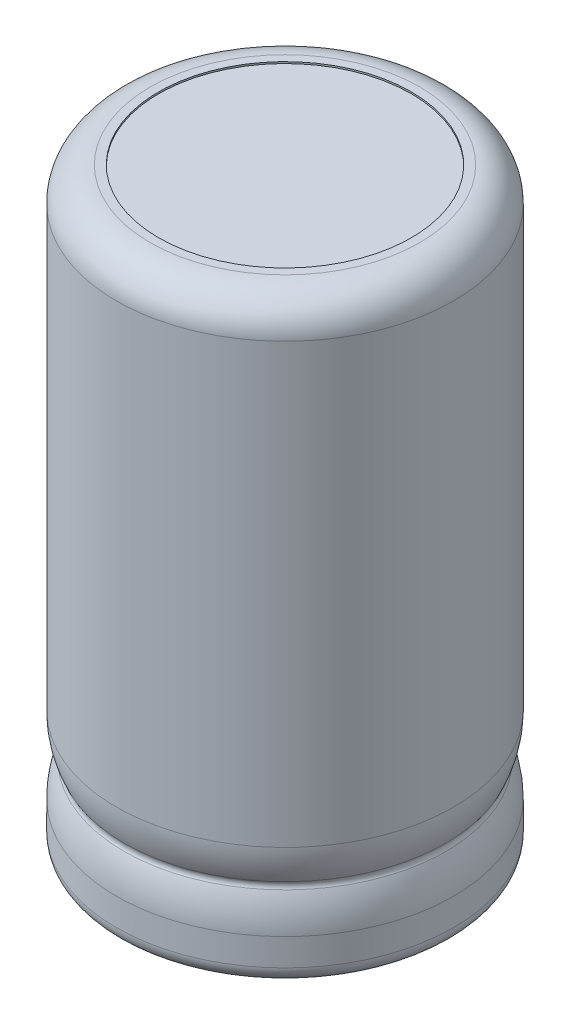
ISO-10303-21;
HEADER;
FILE_DESCRIPTION(('STEP AP214'),'2;1');
FILE_NAME('part.step','',(''),(''),'','','');
FILE_SCHEMA(('AUTOMOTIVE_DESIGN { 1 0 10303 214 1 1 1 1 }'));
ENDSEC;
DATA;
#1=APPLICATION_CONTEXT('core data for automotive mechanical design processes');
#2=APPLICATION_PROTOCOL_DEFINITION('international standard','automotive_design',2000,#1);
#3=PRODUCT_CONTEXT('',#1,'mechanical');
#4=PRODUCT('Part','Part','',(#3));
#5=PRODUCT_RELATED_PRODUCT_CATEGORY('part','',(#4));
#6=PRODUCT_DEFINITION_FORMATION('','',#4);
#7=PRODUCT_DEFINITION_CONTEXT('part definition',#1,'design');
#8=PRODUCT_DEFINITION('design','',#6,#7);
#9=PRODUCT_DEFINITION_SHAPE('','',#8);
#10=(LENGTH_UNIT() NAMED_UNIT(*) SI_UNIT(.MILLI.,.METRE.));
#11=(NAMED_UNIT(*) PLANE_ANGLE_UNIT() SI_UNIT($,.RADIAN.));
#12=(NAMED_UNIT(*) SI_UNIT($,.STERADIAN.) SOLID_ANGLE_UNIT());
#13=UNCERTAINTY_MEASURE_WITH_UNIT(LENGTH_MEASURE(1.E-05),#10,'distance_accuracy_value','');
#14=(GEOMETRIC_REPRESENTATION_CONTEXT(3) GLOBAL_UNCERTAINTY_ASSIGNED_CONTEXT((#13)) GLOBAL_UNIT_ASSIGNED_CONTEXT((#10,
#11,#12)) REPRESENTATION_CONTEXT('',''));
#15=CARTESIAN_POINT('',(0.,0.,0.));
#16=DIRECTION('',(0.,0.,1.));
#17=DIRECTION('',(1.,0.,0.));
#18=AXIS2_PLACEMENT_3D('',#15,#16,#17);
#19=CARTESIAN_POINT('',(-5.08,0.,0.));
#20=DIRECTION('',(0.,1.,0.));
#21=DIRECTION('',(0.,0.,1.));
#22=AXIS2_PLACEMENT_3D('',#19,#20,#21);
#23=PLANE('',#22);
#24=CARTESIAN_POINT('',(-5.08,0.,0.));
#25=DIRECTION('',(0.,1.,0.));
#26=DIRECTION('',(0.,0.,1.));
#27=AXIS2_PLACEMENT_3D('',#24,#25,#26);
#28=CIRCLE('',#27,9.);
#29=CARTESIAN_POINT('',(-5.08,0.,9.));
#30=VERTEX_POINT('',#29);
#31=EDGE_CURVE('E38',#30,#30,#28,.F.);
#32=ORIENTED_EDGE('',*,*,#31,.T.);
#33=EDGE_LOOP('',(#32));
#34=FACE_BOUND('',#33,.T.);
#35=CARTESIAN_POINT('',(-5.08,0.,0.));
#36=DIRECTION('',(0.,-1.,0.));
#37=DIRECTION('',(0.,0.,-1.));
#38=AXIS2_PLACEMENT_3D('',#35,#36,#37);
#39=CIRCLE('',#38,7.5);
#40=CARTESIAN_POINT('',(-5.08,0.,-7.5));
#41=VERTEX_POINT('',#40);
#42=EDGE_CURVE('E58',#41,#41,#39,.T.);
#43=ORIENTED_EDGE('',*,*,#42,.F.);
#44=EDGE_LOOP('',(#43));
#45=FACE_BOUND('',#44,.T.);
#46=ADVANCED_FACE('F31',(#34,#45),#23,.F.);
#47=CARTESIAN_POINT('',(-5.08,35.2,0.));
#48=DIRECTION('',(0.,-1.,0.));
#49=DIRECTION('',(0.,0.,-1.));
#50=AXIS2_PLACEMENT_3D('',#47,#48,#49);
#51=CYLINDRICAL_SURFACE('',#50,10.);
#52=CARTESIAN_POINT('',(-5.08,2.61,0.));
#53=DIRECTION('',(0.,-1.,0.));
#54=DIRECTION('',(0.,0.,-1.));
#55=AXIS2_PLACEMENT_3D('',#52,#53,#54);
#56=CIRCLE('',#55,10.);
#57=CARTESIAN_POINT('',(-5.08,2.61,-10.));
#58=VERTEX_POINT('',#57);
#59=EDGE_CURVE('E72',#58,#58,#56,.T.);
#60=ORIENTED_EDGE('',*,*,#59,.T.);
#61=EDGE_LOOP('',(#60));
#62=FACE_BOUND('',#61,.T.);
#63=CARTESIAN_POINT('',(-5.08,1.,0.));
#64=DIRECTION('',(0.,1.,0.));
#65=DIRECTION('',(0.,0.,1.));
#66=AXIS2_PLACEMENT_3D('',#63,#64,#65);
#67=CIRCLE('',#66,10.);
#68=CARTESIAN_POINT('',(-5.08,1.,10.));
#69=VERTEX_POINT('',#68);
#70=EDGE_CURVE('E10',#69,#69,#67,.T.);
#71=ORIENTED_EDGE('',*,*,#70,.T.);
#72=EDGE_LOOP('',(#71));
#73=FACE_BOUND('',#72,.T.);
#74=ADVANCED_FACE('F112',(#62,#73),#51,.T.);
#75=CARTESIAN_POINT('',(-5.08,0.1,0.));
#76=DIRECTION('',(0.,-1.,0.));
#77=DIRECTION('',(0.,0.,-1.));
#78=AXIS2_PLACEMENT_3D('',#75,#76,#77);
#79=CYLINDRICAL_SURFACE('',#78,7.5);
#80=CARTESIAN_POINT('',(-5.08,0.1,0.));
#81=DIRECTION('',(0.,-1.,0.));
#82=DIRECTION('',(0.,0.,-1.));
#83=AXIS2_PLACEMENT_3D('',#80,#81,#82);
#84=CIRCLE('',#83,7.5);
#85=CARTESIAN_POINT('',(-5.08,0.1,-7.5));
#86=VERTEX_POINT('',#85);
#87=EDGE_CURVE('E57',#86,#86,#84,.T.);
#88=ORIENTED_EDGE('',*,*,#87,.F.);
#89=EDGE_LOOP('',(#88));
#90=FACE_BOUND('',#89,.T.);
#91=ORIENTED_EDGE('',*,*,#42,.T.);
#92=EDGE_LOOP('',(#91));
#93=FACE_BOUND('',#92,.T.);
#94=ADVANCED_FACE('F118',(#90,#93),#79,.F.);
#95=CARTESIAN_POINT('',(-5.08,0.1,0.));
#96=DIRECTION('',(0.,-1.,0.));
#97=DIRECTION('',(0.,0.,-1.));
#98=AXIS2_PLACEMENT_3D('',#95,#96,#97);
#99=PLANE('',#98);
#100=CARTESIAN_POINT('',(-10.16,0.1,0.));
#101=DIRECTION('',(0.,-1.,0.));
#102=DIRECTION('',(0.,0.,-1.));
#103=AXIS2_PLACEMENT_3D('',#100,#101,#102);
#104=CIRCLE('',#103,0.500000000000003);
#105=CARTESIAN_POINT('',(-10.16,0.1,-0.500000000000003));
#106=VERTEX_POINT('',#105);
#107=EDGE_CURVE('E66',#106,#106,#104,.T.);
#108=ORIENTED_EDGE('',*,*,#107,.F.);
#109=EDGE_LOOP('',(#108));
#110=FACE_BOUND('',#109,.T.);
#111=CARTESIAN_POINT('',(0.,0.1,0.));
#112=DIRECTION('',(0.,-1.,0.));
#113=DIRECTION('',(0.,0.,-1.));
#114=AXIS2_PLACEMENT_3D('',#111,#112,#113);
#115=CIRCLE('',#114,0.5);
#116=CARTESIAN_POINT('',(0.,0.1,-0.5));
#117=VERTEX_POINT('',#116);
#118=EDGE_CURVE('E61',#117,#117,#115,.T.);
#119=ORIENTED_EDGE('',*,*,#118,.F.);
#120=EDGE_LOOP('',(#119));
#121=FACE_BOUND('',#120,.T.);
#122=ORIENTED_EDGE('',*,*,#87,.T.);
#123=EDGE_LOOP('',(#122));
#124=FACE_BOUND('',#123,.T.);
#125=ADVANCED_FACE('F132',(#110,#121,#124),#99,.T.);
#126=CARTESIAN_POINT('',(0.,-3.,0.));
#127=DIRECTION('',(0.,1.,0.));
#128=DIRECTION('',(0.,0.,1.));
#129=AXIS2_PLACEMENT_3D('',#126,#127,#128);
#130=PLANE('',#129);
#131=CARTESIAN_POINT('',(0.,-3.,0.));
#132=DIRECTION('',(0.,1.,0.));
#133=DIRECTION('',(0.,0.,1.));
#134=AXIS2_PLACEMENT_3D('',#131,#132,#133);
#135=CIRCLE('',#134,0.5);
#136=CARTESIAN_POINT('',(0.,-3.,0.5));
#137=VERTEX_POINT('',#136);
#138=EDGE_CURVE('E51',#137,#137,#135,.T.);
#139=ORIENTED_EDGE('',*,*,#138,.F.);
#140=EDGE_LOOP('',(#139));
#141=FACE_BOUND('',#140,.T.);
#142=ADVANCED_FACE('F128',(#141),#130,.F.);
#143=CARTESIAN_POINT('',(0.,-3.,0.));
#144=DIRECTION('',(0.,1.,0.));
#145=DIRECTION('',(0.,0.,1.));
#146=AXIS2_PLACEMENT_3D('',#143,#144,#145);
#147=CYLINDRICAL_SURFACE('',#146,0.5);
#148=ORIENTED_EDGE('',*,*,#138,.T.);
#149=EDGE_LOOP('',(#148));
#150=FACE_BOUND('',#149,.T.);
#151=ORIENTED_EDGE('',*,*,#118,.T.);
#152=EDGE_LOOP('',(#151));
#153=FACE_BOUND('',#152,.T.);
#154=ADVANCED_FACE('F131',(#150,#153),#147,.T.);
#155=CARTESIAN_POINT('',(-10.16,-3.,0.));
#156=DIRECTION('',(0.,-1.,0.));
#157=DIRECTION('',(0.,0.,-1.));
#158=AXIS2_PLACEMENT_3D('',#155,#156,#157);
#159=PLANE('',#158);
#160=CARTESIAN_POINT('',(-10.16,-3.,0.));
#161=DIRECTION('',(0.,-1.,0.));
#162=DIRECTION('',(0.,0.,-1.));
#163=AXIS2_PLACEMENT_3D('',#160,#161,#162);
#164=CIRCLE('',#163,0.500000000000004);
#165=CARTESIAN_POINT('',(-10.16,-3.,-0.500000000000004));
#166=VERTEX_POINT('',#165);
#167=EDGE_CURVE('E54',#166,#166,#164,.T.);
#168=ORIENTED_EDGE('',*,*,#167,.T.);
#169=EDGE_LOOP('',(#168));
#170=FACE_BOUND('',#169,.T.);
#171=ADVANCED_FACE('F135',(#170),#159,.T.);
#172=CARTESIAN_POINT('',(-10.16,-3.,0.));
#173=DIRECTION('',(0.,1.,0.));
#174=DIRECTION('',(0.,0.,1.));
#175=AXIS2_PLACEMENT_3D('',#172,#173,#174);
#176=CYLINDRICAL_SURFACE('',#175,0.500000000000004);
#177=ORIENTED_EDGE('',*,*,#167,.F.);
#178=EDGE_LOOP('',(#177));
#179=FACE_BOUND('',#178,.T.);
#180=ORIENTED_EDGE('',*,*,#107,.T.);
#181=EDGE_LOOP('',(#180));
#182=FACE_BOUND('',#181,.T.);
#183=ADVANCED_FACE('F127',(#179,#182),#176,.T.);
#184=CARTESIAN_POINT('',(-5.08,1.,0.));
#185=DIRECTION('',(0.,1.,0.));
#186=DIRECTION('',(0.,0.,1.));
#187=AXIS2_PLACEMENT_3D('',#184,#185,#186);
#188=TOROIDAL_SURFACE('',#187,9.,1.);
#189=ORIENTED_EDGE('',*,*,#70,.F.);
#190=EDGE_LOOP('',(#189));
#191=FACE_BOUND('',#190,.T.);
#192=ORIENTED_EDGE('',*,*,#31,.F.);
#193=EDGE_LOOP('',(#192));
#194=FACE_BOUND('',#193,.T.);
#195=ADVANCED_FACE('F33',(#191,#194),#188,.T.);
#196=CARTESIAN_POINT('',(-5.08,7.19,0.));
#197=DIRECTION('',(0.,-1.,0.));
#198=DIRECTION('',(0.,0.,-1.));
#199=AXIS2_PLACEMENT_3D('',#196,#197,#198);
#200=TOROIDAL_SURFACE('',#199,5.01821428571427,4.98178571428573);
#201=CARTESIAN_POINT('',(-5.08,5.11,0.));
#202=DIRECTION('',(0.,-1.,0.));
#203=DIRECTION('',(0.,0.,-1.));
#204=AXIS2_PLACEMENT_3D('',#201,#202,#203);
#205=CIRCLE('',#204,9.545);
#206=CARTESIAN_POINT('',(-5.08,5.11,-9.545));
#207=VERTEX_POINT('',#206);
#208=EDGE_CURVE('E78',#207,#207,#205,.T.);
#209=ORIENTED_EDGE('',*,*,#208,.F.);
#210=EDGE_LOOP('',(#209));
#211=FACE_BOUND('',#210,.T.);
#212=CARTESIAN_POINT('',(-5.08,7.19,0.));
#213=DIRECTION('',(0.,-1.,0.));
#214=DIRECTION('',(0.,0.,-1.));
#215=AXIS2_PLACEMENT_3D('',#212,#213,#214);
#216=CIRCLE('',#215,10.);
#217=CARTESIAN_POINT('',(-5.08,7.19,-10.));
#218=VERTEX_POINT('',#217);
#219=EDGE_CURVE('E69',#218,#218,#216,.T.);
#220=ORIENTED_EDGE('',*,*,#219,.T.);
#221=EDGE_LOOP('',(#220));
#222=FACE_BOUND('',#221,.T.);
#223=ADVANCED_FACE('F158',(#211,#222),#200,.T.);
#224=CARTESIAN_POINT('',(-5.08,2.61,0.));
#225=DIRECTION('',(0.,-1.,0.));
#226=DIRECTION('',(0.,0.,-1.));
#227=AXIS2_PLACEMENT_3D('',#224,#225,#226);
#228=TOROIDAL_SURFACE('',#227,5.01821428571427,4.98178571428574);
#229=ORIENTED_EDGE('',*,*,#59,.F.);
#230=EDGE_LOOP('',(#229));
#231=FACE_BOUND('',#230,.T.);
#232=CARTESIAN_POINT('',(-5.08,4.69,0.));
#233=DIRECTION('',(0.,-1.,0.));
#234=DIRECTION('',(0.,0.,-1.));
#235=AXIS2_PLACEMENT_3D('',#232,#233,#234);
#236=CIRCLE('',#235,9.545);
#237=CARTESIAN_POINT('',(-5.08,4.69,-9.545));
#238=VERTEX_POINT('',#237);
#239=EDGE_CURVE('E75',#238,#238,#236,.T.);
#240=ORIENTED_EDGE('',*,*,#239,.T.);
#241=EDGE_LOOP('',(#240));
#242=FACE_BOUND('',#241,.T.);
#243=ADVANCED_FACE('F161',(#231,#242),#228,.T.);
#244=CARTESIAN_POINT('',(-5.08,4.9,0.));
#245=DIRECTION('',(0.,-1.,0.));
#246=DIRECTION('',(0.,0.,-1.));
#247=AXIS2_PLACEMENT_3D('',#244,#245,#246);
#248=TOROIDAL_SURFACE('',#247,9.845,0.366196668472011);
#249=ORIENTED_EDGE('',*,*,#239,.F.);
#250=EDGE_LOOP('',(#249));
#251=FACE_BOUND('',#250,.T.);
#252=ORIENTED_EDGE('',*,*,#208,.T.);
#253=EDGE_LOOP('',(#252));
#254=FACE_BOUND('',#253,.T.);
#255=ADVANCED_FACE('F101',(#251,#254),#248,.F.);
#256=CARTESIAN_POINT('',(-5.08,35.2,0.));
#257=DIRECTION('',(0.,-1.,0.));
#258=DIRECTION('',(0.,0.,-1.));
#259=AXIS2_PLACEMENT_3D('',#256,#257,#258);
#260=PLANE('',#259);
#261=CARTESIAN_POINT('',(-5.08,35.2,0.));
#262=DIRECTION('',(0.,1.,0.));
#263=DIRECTION('',(0.,0.,1.));
#264=AXIS2_PLACEMENT_3D('',#261,#262,#263);
#265=CIRCLE('',#264,7.5);
#266=CARTESIAN_POINT('',(-5.08,35.2,7.5));
#267=VERTEX_POINT('',#266);
#268=EDGE_CURVE('E82',#267,#267,#265,.T.);
#269=ORIENTED_EDGE('',*,*,#268,.F.);
#270=EDGE_LOOP('',(#269));
#271=FACE_BOUND('',#270,.T.);
#272=CARTESIAN_POINT('',(-5.08,35.2,0.));
#273=DIRECTION('',(0.,-1.,0.));
#274=DIRECTION('',(0.,0.,-1.));
#275=AXIS2_PLACEMENT_3D('',#272,#273,#274);
#276=CIRCLE('',#275,8.);
#277=CARTESIAN_POINT('',(-5.08,35.2,-8.));
#278=VERTEX_POINT('',#277);
#279=EDGE_CURVE('E42',#278,#278,#276,.F.);
#280=ORIENTED_EDGE('',*,*,#279,.T.);
#281=EDGE_LOOP('',(#280));
#282=FACE_BOUND('',#281,.T.);
#283=ADVANCED_FACE('F97',(#271,#282),#260,.F.);
#284=CARTESIAN_POINT('',(-5.08,33.2,0.));
#285=DIRECTION('',(0.,-1.,0.));
#286=DIRECTION('',(0.,0.,-1.));
#287=AXIS2_PLACEMENT_3D('',#284,#285,#286);
#288=TOROIDAL_SURFACE('',#287,8.,2.);
#289=ORIENTED_EDGE('',*,*,#279,.F.);
#290=EDGE_LOOP('',(#289));
#291=FACE_BOUND('',#290,.T.);
#292=CARTESIAN_POINT('',(-5.08,33.2,0.));
#293=DIRECTION('',(0.,-1.,0.));
#294=DIRECTION('',(0.,0.,-1.));
#295=AXIS2_PLACEMENT_3D('',#292,#293,#294);
#296=CIRCLE('',#295,10.);
#297=CARTESIAN_POINT('',(-5.08,33.2,-10.));
#298=VERTEX_POINT('',#297);
#299=EDGE_CURVE('E46',#298,#298,#296,.T.);
#300=ORIENTED_EDGE('',*,*,#299,.F.);
#301=EDGE_LOOP('',(#300));
#302=FACE_BOUND('',#301,.T.);
#303=ADVANCED_FACE('F100',(#291,#302),#288,.T.);
#304=ORIENTED_EDGE('',*,*,#219,.F.);
#305=EDGE_LOOP('',(#304));
#306=FACE_BOUND('',#305,.T.);
#307=ORIENTED_EDGE('',*,*,#299,.T.);
#308=EDGE_LOOP('',(#307));
#309=FACE_BOUND('',#308,.T.);
#310=ADVANCED_FACE('F93',(#306,#309),#51,.T.);
#311=CARTESIAN_POINT('',(-5.08,35.1,0.));
#312=DIRECTION('',(0.,1.,0.));
#313=DIRECTION('',(0.,0.,1.));
#314=AXIS2_PLACEMENT_3D('',#311,#312,#313);
#315=CYLINDRICAL_SURFACE('',#314,7.5);
#316=CARTESIAN_POINT('',(-5.08,35.1,0.));
#317=DIRECTION('',(0.,1.,0.));
#318=DIRECTION('',(0.,0.,1.));
#319=AXIS2_PLACEMENT_3D('',#316,#317,#318);
#320=CIRCLE('',#319,7.5);
#321=CARTESIAN_POINT('',(-5.08,35.1,7.5));
#322=VERTEX_POINT('',#321);
#323=EDGE_CURVE('E81',#322,#322,#320,.T.);
#324=ORIENTED_EDGE('',*,*,#323,.F.);
#325=EDGE_LOOP('',(#324));
#326=FACE_BOUND('',#325,.T.);
#327=ORIENTED_EDGE('',*,*,#268,.T.);
#328=EDGE_LOOP('',(#327));
#329=FACE_BOUND('',#328,.T.);
#330=ADVANCED_FACE('F90',(#326,#329),#315,.F.);
#331=CARTESIAN_POINT('',(-5.08,35.1,0.));
#332=DIRECTION('',(0.,1.,0.));
#333=DIRECTION('',(0.,0.,1.));
#334=AXIS2_PLACEMENT_3D('',#331,#332,#333);
#335=PLANE('',#334);
#336=ORIENTED_EDGE('',*,*,#323,.T.);
#337=EDGE_LOOP('',(#336));
#338=FACE_BOUND('',#337,.T.);
#339=ADVANCED_FACE('F88',(#338),#335,.T.);
#340=CLOSED_SHELL('',(#46,#74,#94,#125,#142,#154,#171,#183,#195,#223,#243,#255,#283,#303,#310,
#330,#339));
#341=MANIFOLD_SOLID_BREP('B2',#340);
#342=ADVANCED_BREP_SHAPE_REPRESENTATION('',(#18,#341),#14);
#343=SHAPE_DEFINITION_REPRESENTATION(#9,#342);
ENDSEC;
END-ISO-10303-21;
